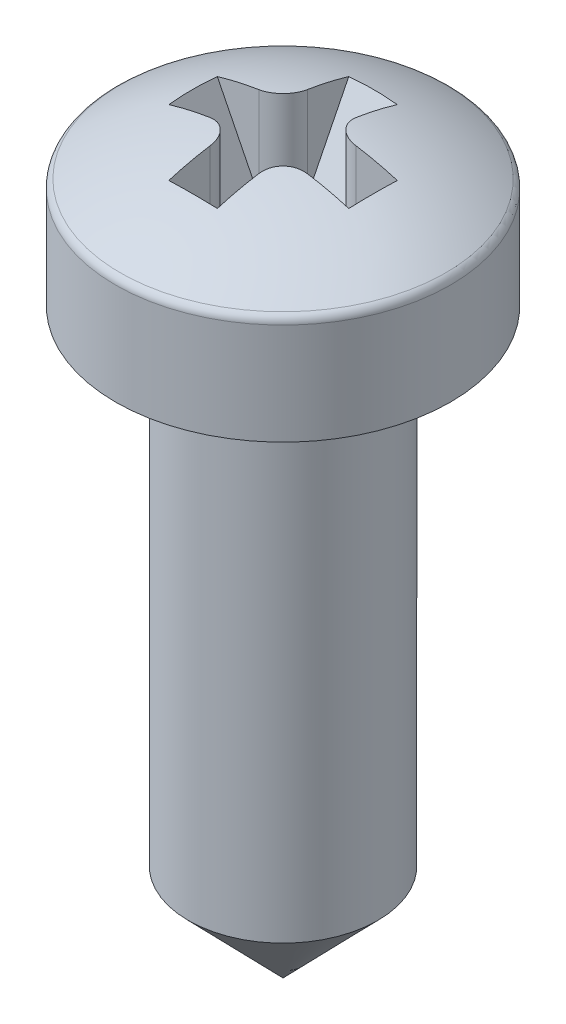
ISO-10303-21;
HEADER;
FILE_DESCRIPTION(('STEP AP214'),'2;1');
FILE_NAME('part.step','',(''),(''),'','','');
FILE_SCHEMA(('AUTOMOTIVE_DESIGN { 1 0 10303 214 1 1 1 1 }'));
ENDSEC;
DATA;
#1=APPLICATION_CONTEXT('core data for automotive mechanical design processes');
#2=APPLICATION_PROTOCOL_DEFINITION('international standard','automotive_design',2000,#1);
#3=PRODUCT_CONTEXT('',#1,'mechanical');
#4=PRODUCT('Part','Part','',(#3));
#5=PRODUCT_RELATED_PRODUCT_CATEGORY('part','',(#4));
#6=PRODUCT_DEFINITION_FORMATION('','',#4);
#7=PRODUCT_DEFINITION_CONTEXT('part definition',#1,'design');
#8=PRODUCT_DEFINITION('design','',#6,#7);
#9=PRODUCT_DEFINITION_SHAPE('','',#8);
#10=(LENGTH_UNIT() NAMED_UNIT(*) SI_UNIT(.MILLI.,.METRE.));
#11=(NAMED_UNIT(*) PLANE_ANGLE_UNIT() SI_UNIT($,.RADIAN.));
#12=(NAMED_UNIT(*) SI_UNIT($,.STERADIAN.) SOLID_ANGLE_UNIT());
#13=UNCERTAINTY_MEASURE_WITH_UNIT(LENGTH_MEASURE(1.E-05),#10,'distance_accuracy_value','');
#14=(GEOMETRIC_REPRESENTATION_CONTEXT(3) GLOBAL_UNCERTAINTY_ASSIGNED_CONTEXT((#13)) GLOBAL_UNIT_ASSIGNED_CONTEXT((#10,
#11,#12)) REPRESENTATION_CONTEXT('',''));
#15=CARTESIAN_POINT('',(0.,0.,0.));
#16=DIRECTION('',(0.,0.,1.));
#17=DIRECTION('',(1.,0.,0.));
#18=AXIS2_PLACEMENT_3D('',#15,#16,#17);
#19=CARTESIAN_POINT('',(0.,0.,0.));
#20=DIRECTION('',(0.,1.,0.));
#21=DIRECTION('',(0.,0.,1.));
#22=AXIS2_PLACEMENT_3D('',#19,#20,#21);
#23=PLANE('',#22);
#24=CARTESIAN_POINT('',(0.,0.,0.));
#25=DIRECTION('',(0.,1.,0.));
#26=DIRECTION('',(0.,0.,1.));
#27=AXIS2_PLACEMENT_3D('',#24,#25,#26);
#28=CIRCLE('',#27,3.45);
#29=CARTESIAN_POINT('',(0.,0.,3.45));
#30=VERTEX_POINT('',#29);
#31=EDGE_CURVE('E339',#30,#30,#28,.T.);
#32=ORIENTED_EDGE('',*,*,#31,.F.);
#33=EDGE_LOOP('',(#32));
#34=FACE_BOUND('',#33,.T.);
#35=CARTESIAN_POINT('',(0.,0.,0.));
#36=DIRECTION('',(0.,1.,0.));
#37=DIRECTION('',(0.,0.,1.));
#38=AXIS2_PLACEMENT_3D('',#35,#36,#37);
#39=CIRCLE('',#38,1.95);
#40=CARTESIAN_POINT('',(0.,0.,1.95));
#41=VERTEX_POINT('',#40);
#42=EDGE_CURVE('E336',#41,#41,#39,.F.);
#43=ORIENTED_EDGE('',*,*,#42,.F.);
#44=EDGE_LOOP('',(#43));
#45=FACE_BOUND('',#44,.T.);
#46=ADVANCED_FACE('F32',(#34,#45),#23,.F.);
#47=CARTESIAN_POINT('',(0.,2.2,0.));
#48=DIRECTION('',(0.,-1.,0.));
#49=DIRECTION('',(0.,0.,-1.));
#50=AXIS2_PLACEMENT_3D('',#47,#48,#49);
#51=CYLINDRICAL_SURFACE('',#50,3.45);
#52=CARTESIAN_POINT('',(0.,2.08875248712489,0.));
#53=DIRECTION('',(0.,-1.,0.));
#54=DIRECTION('',(0.,0.,-1.));
#55=AXIS2_PLACEMENT_3D('',#52,#53,#54);
#56=CIRCLE('',#55,3.45);
#57=CARTESIAN_POINT('',(0.,2.08875248712489,-3.45));
#58=VERTEX_POINT('',#57);
#59=EDGE_CURVE('E327',#58,#58,#56,.T.);
#60=ORIENTED_EDGE('',*,*,#59,.T.);
#61=EDGE_LOOP('',(#60));
#62=FACE_BOUND('',#61,.T.);
#63=ORIENTED_EDGE('',*,*,#31,.T.);
#64=EDGE_LOOP('',(#63));
#65=FACE_BOUND('',#64,.T.);
#66=ADVANCED_FACE('F146',(#62,#65),#51,.T.);
#67=CARTESIAN_POINT('',(0.,-3.25125,0.));
#68=DIRECTION('',(0.,0.,1.));
#69=DIRECTION('',(1.,0.,0.));
#70=AXIS2_PLACEMENT_3D('',#67,#68,#69);
#71=SPHERICAL_SURFACE('',#70,6.45125);
#72=CARTESIAN_POINT('',(-0.5,-3.25125,0.));
#73=DIRECTION('',(-1.,0.,0.));
#74=DIRECTION('',(0.,0.,1.));
#75=AXIS2_PLACEMENT_3D('',#72,#73,#74);
#76=CIRCLE('',#75,6.43184472468825);
#77=CARTESIAN_POINT('',(-0.5,3.10238097468684,1.));
#78=VERTEX_POINT('',#77);
#79=CARTESIAN_POINT('',(-0.5,2.90764366493432,1.85382183246716));
#80=VERTEX_POINT('',#79);
#81=EDGE_CURVE('E306',#78,#80,#76,.F.);
#82=ORIENTED_EDGE('',*,*,#81,.F.);
#83=CARTESIAN_POINT('',(-0.5,3.10238097468684,1.));
#84=CARTESIAN_POINT('',(-0.499975195760788,3.10673438845621,0.972364508087572));
#85=CARTESIAN_POINT('',(-0.502290117258133,3.11072459761779,0.944669073248839));
#86=CARTESIAN_POINT('',(-0.511481797928051,3.11787835492255,0.889939977008393));
#87=CARTESIAN_POINT('',(-0.51835803182,3.12104199819457,0.862906239777261));
#88=CARTESIAN_POINT('',(-0.536563939533955,3.12644614170445,0.810248959480661));
#89=CARTESIAN_POINT('',(-0.547898093791047,3.12868570854423,0.784626864815989));
#90=CARTESIAN_POINT('',(-0.574713648113397,3.13216743478294,0.735592096428243));
#91=CARTESIAN_POINT('',(-0.590193251223239,3.13341002541741,0.712178471317527));
#92=CARTESIAN_POINT('',(-0.624641996725747,3.13485007024244,0.668534488015013));
#93=CARTESIAN_POINT('',(-0.643563281484364,3.13506086934354,0.648266785274757));
#94=CARTESIAN_POINT('',(-0.684486330764666,3.13446686521321,0.611137051910229));
#95=CARTESIAN_POINT('',(-0.706488459759454,3.13366194172837,0.594275424812246));
#96=CARTESIAN_POINT('',(-0.752789291528574,3.13106955452091,0.564523366769589));
#97=CARTESIAN_POINT('',(-0.777073551147957,3.129287965258,0.551609904725466));
#98=CARTESIAN_POINT('',(-0.827355150609405,3.12479984438961,0.529954823615046));
#99=CARTESIAN_POINT('',(-0.853352118617411,3.12209351301772,0.52121230239979));
#100=CARTESIAN_POINT('',(-0.899533861080243,3.11663909185702,0.509776371995801));
#101=CARTESIAN_POINT('',(-0.919506050104829,3.11407843900143,0.506108020278519));
#102=CARTESIAN_POINT('',(-0.959660663494023,3.10853573262139,0.501219166253551));
#103=CARTESIAN_POINT('',(-0.979842743940679,3.1055542908469,0.499995148791129));
#104=CARTESIAN_POINT('',(-1.,3.10238097468684,0.5));
#105=B_SPLINE_CURVE_WITH_KNOTS('',3,(#83,#84,#85,#86,#87,#88,#89,#90,#91,#92,#93,#94,#95,#96,
#97,#98,#99,#100,#101,#102,#103,#104),.UNSPECIFIED.,.F.,.F.,(4,2,2,2,2,2,2,2,2,2,4),(0.,
0.0838351087463272,0.167660564719248,0.251570485679243,0.335444092355853,0.418229980858303,
0.501025671466905,0.583328740318609,0.66561399944084,0.726869734567323,0.788037315262509),.UNSPECIFIED.);
#106=CARTESIAN_POINT('',(-1.,3.10238097468684,0.5));
#107=VERTEX_POINT('',#106);
#108=EDGE_CURVE('E183',#78,#107,#105,.T.);
#109=ORIENTED_EDGE('',*,*,#108,.T.);
#110=CARTESIAN_POINT('',(0.,-3.25125,0.5));
#111=DIRECTION('',(0.,0.,1.));
#112=DIRECTION('',(1.,0.,0.));
#113=AXIS2_PLACEMENT_3D('',#110,#111,#112);
#114=CIRCLE('',#113,6.43184472468825);
#115=CARTESIAN_POINT('',(-1.85382183246716,2.90764366493432,0.5));
#116=VERTEX_POINT('',#115);
#117=EDGE_CURVE('E323',#116,#107,#114,.F.);
#118=ORIENTED_EDGE('',*,*,#117,.F.);
#119=CARTESIAN_POINT('',(0.9805,-2.761,0.));
#120=DIRECTION('',(-0.894427190999916,-0.447213595499958,0.));
#121=DIRECTION('',(0.447213595499958,-0.894427190999916,0.));
#122=AXIS2_PLACEMENT_3D('',#119,#120,#121);
#123=CIRCLE('',#122,6.35742882382493);
#124=CARTESIAN_POINT('',(-1.85382183246716,2.90764366493432,-0.5));
#125=VERTEX_POINT('',#124);
#126=EDGE_CURVE('E237',#116,#125,#123,.T.);
#127=ORIENTED_EDGE('',*,*,#126,.T.);
#128=CARTESIAN_POINT('',(0.,-3.25125,-0.5));
#129=DIRECTION('',(0.,0.,-1.));
#130=DIRECTION('',(-1.,0.,0.));
#131=AXIS2_PLACEMENT_3D('',#128,#129,#130);
#132=CIRCLE('',#131,6.43184472468825);
#133=CARTESIAN_POINT('',(-1.,3.10238097468684,-0.5));
#134=VERTEX_POINT('',#133);
#135=EDGE_CURVE('E250',#134,#125,#132,.F.);
#136=ORIENTED_EDGE('',*,*,#135,.F.);
#137=CARTESIAN_POINT('',(-1.,3.10238097468684,-0.5));
#138=CARTESIAN_POINT('',(-0.972364508087572,3.10673438845621,-0.499975195760788));
#139=CARTESIAN_POINT('',(-0.944669073248839,3.11072459761779,-0.502290117258133));
#140=CARTESIAN_POINT('',(-0.889939977008393,3.11787835492255,-0.511481797928051));
#141=CARTESIAN_POINT('',(-0.862906239777261,3.12104199819457,-0.51835803182));
#142=CARTESIAN_POINT('',(-0.810248959480661,3.12644614170445,-0.536563939533956));
#143=CARTESIAN_POINT('',(-0.78462686481599,3.12868570854423,-0.547898093791047));
#144=CARTESIAN_POINT('',(-0.735592096428243,3.13216743478294,-0.574713648113397));
#145=CARTESIAN_POINT('',(-0.712178471317528,3.13341002541741,-0.590193251223239));
#146=CARTESIAN_POINT('',(-0.668534488015013,3.13485007024244,-0.624641996725747));
#147=CARTESIAN_POINT('',(-0.648266785274757,3.13506086934354,-0.643563281484364));
#148=CARTESIAN_POINT('',(-0.61113705191023,3.13446686521321,-0.684486330764666));
#149=CARTESIAN_POINT('',(-0.594275424812246,3.13366194172837,-0.706488459759454));
#150=CARTESIAN_POINT('',(-0.564523366769589,3.13106955452091,-0.752789291528575));
#151=CARTESIAN_POINT('',(-0.551609904725466,3.129287965258,-0.777073551147958));
#152=CARTESIAN_POINT('',(-0.529954823615047,3.12479984438961,-0.827355150609405));
#153=CARTESIAN_POINT('',(-0.52121230239979,3.12209351301772,-0.853352118617412));
#154=CARTESIAN_POINT('',(-0.509776371995801,3.11663909185702,-0.899533861080243));
#155=CARTESIAN_POINT('',(-0.506108020278519,3.11407843900143,-0.91950605010483));
#156=CARTESIAN_POINT('',(-0.501219166253552,3.10853573262139,-0.959660663494023));
#157=CARTESIAN_POINT('',(-0.499995148791129,3.1055542908469,-0.979842743940679));
#158=CARTESIAN_POINT('',(-0.5,3.10238097468684,-1.));
#159=B_SPLINE_CURVE_WITH_KNOTS('',3,(#137,#138,#139,#140,#141,#142,#143,#144,#145,#146,#147,
#148,#149,#150,#151,#152,#153,#154,#155,#156,#157,#158),.UNSPECIFIED.,.F.,.F.,(4,2,2,2,2,2,2,2,
2,2,4),(0.,0.0838351087463272,0.167660564719248,0.251570485679243,0.335444092355853,
0.418229980858303,0.501025671466905,0.583328740318609,0.66561399944084,0.726869734567323,
0.788037315262509),.UNSPECIFIED.);
#160=CARTESIAN_POINT('',(-0.5,3.10238097468684,-1.));
#161=VERTEX_POINT('',#160);
#162=EDGE_CURVE('E171',#134,#161,#159,.T.);
#163=ORIENTED_EDGE('',*,*,#162,.T.);
#164=CARTESIAN_POINT('',(-0.5,-3.25125,0.));
#165=DIRECTION('',(-1.,0.,0.));
#166=DIRECTION('',(0.,0.,1.));
#167=AXIS2_PLACEMENT_3D('',#164,#165,#166);
#168=CIRCLE('',#167,6.43184472468825);
#169=CARTESIAN_POINT('',(-0.5,2.90764366493432,-1.85382183246716));
#170=VERTEX_POINT('',#169);
#171=EDGE_CURVE('E244',#170,#161,#168,.F.);
#172=ORIENTED_EDGE('',*,*,#171,.F.);
#173=CARTESIAN_POINT('',(0.,-2.761,0.9805));
#174=DIRECTION('',(0.,-0.447213595499958,-0.894427190999916));
#175=DIRECTION('',(0.,0.894427190999916,-0.447213595499958));
#176=AXIS2_PLACEMENT_3D('',#173,#174,#175);
#177=CIRCLE('',#176,6.35742882382493);
#178=CARTESIAN_POINT('',(0.5,2.90764366493432,-1.85382183246716));
#179=VERTEX_POINT('',#178);
#180=EDGE_CURVE('E41',#170,#179,#177,.T.);
#181=ORIENTED_EDGE('',*,*,#180,.T.);
#182=CARTESIAN_POINT('',(0.5,-3.25125,0.));
#183=DIRECTION('',(1.,0.,0.));
#184=DIRECTION('',(0.,0.,-1.));
#185=AXIS2_PLACEMENT_3D('',#182,#183,#184);
#186=CIRCLE('',#185,6.43184472468825);
#187=CARTESIAN_POINT('',(0.5,3.10238097468684,-1.));
#188=VERTEX_POINT('',#187);
#189=EDGE_CURVE('E242',#188,#179,#186,.F.);
#190=ORIENTED_EDGE('',*,*,#189,.F.);
#191=CARTESIAN_POINT('',(0.5,3.10238097468684,-1.));
#192=CARTESIAN_POINT('',(0.499975195760788,3.10673438845621,-0.972364508087572));
#193=CARTESIAN_POINT('',(0.502290117258133,3.11072459761779,-0.944669073248839));
#194=CARTESIAN_POINT('',(0.51148179792805,3.11787835492255,-0.889939977008393));
#195=CARTESIAN_POINT('',(0.51835803182,3.12104199819457,-0.862906239777261));
#196=CARTESIAN_POINT('',(0.536563939533955,3.12644614170445,-0.810248959480661));
#197=CARTESIAN_POINT('',(0.547898093791047,3.12868570854423,-0.784626864815989));
#198=CARTESIAN_POINT('',(0.574713648113397,3.13216743478294,-0.735592096428243));
#199=CARTESIAN_POINT('',(0.590193251223239,3.13341002541741,-0.712178471317527));
#200=CARTESIAN_POINT('',(0.624641996725747,3.13485007024244,-0.668534488015013));
#201=CARTESIAN_POINT('',(0.643563281484364,3.13506086934354,-0.648266785274757));
#202=CARTESIAN_POINT('',(0.684486330764666,3.13446686521321,-0.611137051910229));
#203=CARTESIAN_POINT('',(0.706488459759454,3.13366194172837,-0.594275424812246));
#204=CARTESIAN_POINT('',(0.752789291528575,3.13106955452091,-0.564523366769589));
#205=CARTESIAN_POINT('',(0.777073551147958,3.129287965258,-0.551609904725466));
#206=CARTESIAN_POINT('',(0.827355150609405,3.12479984438961,-0.529954823615046));
#207=CARTESIAN_POINT('',(0.853352118617412,3.12209351301772,-0.52121230239979));
#208=CARTESIAN_POINT('',(0.899533861080243,3.11663909185702,-0.509776371995801));
#209=CARTESIAN_POINT('',(0.919506050104829,3.11407843900143,-0.506108020278519));
#210=CARTESIAN_POINT('',(0.959660663494023,3.10853573262139,-0.501219166253552));
#211=CARTESIAN_POINT('',(0.979842743940679,3.1055542908469,-0.499995148791129));
#212=CARTESIAN_POINT('',(1.,3.10238097468684,-0.5));
#213=B_SPLINE_CURVE_WITH_KNOTS('',3,(#191,#192,#193,#194,#195,#196,#197,#198,#199,#200,#201,
#202,#203,#204,#205,#206,#207,#208,#209,#210,#211,#212),.UNSPECIFIED.,.F.,.F.,(4,2,2,2,2,2,2,2,
2,2,4),(0.,0.0838351087463272,0.167660564719248,0.251570485679243,0.335444092355853,
0.418229980858303,0.501025671466906,0.583328740318609,0.66561399944084,0.726869734567323,
0.788037315262509),.UNSPECIFIED.);
#214=CARTESIAN_POINT('',(1.,3.10238097468684,-0.5));
#215=VERTEX_POINT('',#214);
#216=EDGE_CURVE('E162',#188,#215,#213,.T.);
#217=ORIENTED_EDGE('',*,*,#216,.T.);
#218=CARTESIAN_POINT('',(0.,-3.25125,-0.5));
#219=DIRECTION('',(0.,0.,-1.));
#220=DIRECTION('',(-1.,0.,0.));
#221=AXIS2_PLACEMENT_3D('',#218,#219,#220);
#222=CIRCLE('',#221,6.43184472468825);
#223=CARTESIAN_POINT('',(1.85382183246716,2.90764366493432,-0.5));
#224=VERTEX_POINT('',#223);
#225=EDGE_CURVE('E248',#224,#215,#222,.F.);
#226=ORIENTED_EDGE('',*,*,#225,.F.);
#227=CARTESIAN_POINT('',(-0.9805,-2.761,0.));
#228=DIRECTION('',(0.894427190999916,-0.447213595499958,0.));
#229=DIRECTION('',(0.447213595499958,0.894427190999916,0.));
#230=AXIS2_PLACEMENT_3D('',#227,#228,#229);
#231=CIRCLE('',#230,6.35742882382493);
#232=CARTESIAN_POINT('',(1.85382183246716,2.90764366493432,0.5));
#233=VERTEX_POINT('',#232);
#234=EDGE_CURVE('E11',#224,#233,#231,.T.);
#235=ORIENTED_EDGE('',*,*,#234,.T.);
#236=CARTESIAN_POINT('',(0.,-3.25125,0.5));
#237=DIRECTION('',(0.,0.,1.));
#238=DIRECTION('',(1.,0.,0.));
#239=AXIS2_PLACEMENT_3D('',#236,#237,#238);
#240=CIRCLE('',#239,6.43184472468825);
#241=CARTESIAN_POINT('',(1.,3.10238097468684,0.5));
#242=VERTEX_POINT('',#241);
#243=EDGE_CURVE('E252',#242,#233,#240,.F.);
#244=ORIENTED_EDGE('',*,*,#243,.F.);
#245=CARTESIAN_POINT('',(1.,3.10238097468684,0.5));
#246=CARTESIAN_POINT('',(0.972364508087572,3.10673438845621,0.499975195760788));
#247=CARTESIAN_POINT('',(0.944669073248839,3.11072459761779,0.502290117258133));
#248=CARTESIAN_POINT('',(0.889939977008393,3.11787835492255,0.511481797928051));
#249=CARTESIAN_POINT('',(0.862906239777261,3.12104199819457,0.51835803182));
#250=CARTESIAN_POINT('',(0.810248959480661,3.12644614170445,0.536563939533955));
#251=CARTESIAN_POINT('',(0.784626864815989,3.12868570854423,0.547898093791047));
#252=CARTESIAN_POINT('',(0.735592096428243,3.13216743478294,0.574713648113397));
#253=CARTESIAN_POINT('',(0.712178471317527,3.13341002541741,0.590193251223239));
#254=CARTESIAN_POINT('',(0.668534488015013,3.13485007024244,0.624641996725747));
#255=CARTESIAN_POINT('',(0.648266785274757,3.13506086934354,0.643563281484364));
#256=CARTESIAN_POINT('',(0.611137051910229,3.13446686521321,0.684486330764666));
#257=CARTESIAN_POINT('',(0.594275424812246,3.13366194172837,0.706488459759454));
#258=CARTESIAN_POINT('',(0.564523366769589,3.13106955452091,0.752789291528574));
#259=CARTESIAN_POINT('',(0.551609904725466,3.129287965258,0.777073551147957));
#260=CARTESIAN_POINT('',(0.529954823615046,3.12479984438961,0.827355150609405));
#261=CARTESIAN_POINT('',(0.52121230239979,3.12209351301772,0.853352118617411));
#262=CARTESIAN_POINT('',(0.509776371995801,3.11663909185702,0.899533861080243));
#263=CARTESIAN_POINT('',(0.506108020278519,3.11407843900143,0.919506050104829));
#264=CARTESIAN_POINT('',(0.501219166253551,3.10853573262139,0.959660663494023));
#265=CARTESIAN_POINT('',(0.499995148791129,3.1055542908469,0.979842743940679));
#266=CARTESIAN_POINT('',(0.5,3.10238097468684,1.));
#267=B_SPLINE_CURVE_WITH_KNOTS('',3,(#245,#246,#247,#248,#249,#250,#251,#252,#253,#254,#255,
#256,#257,#258,#259,#260,#261,#262,#263,#264,#265,#266),.UNSPECIFIED.,.F.,.F.,(4,2,2,2,2,2,2,2,
2,2,4),(0.,0.0838351087463272,0.167660564719248,0.251570485679243,0.335444092355853,
0.418229980858303,0.501025671466905,0.583328740318609,0.66561399944084,0.726869734567323,
0.788037315262509),.UNSPECIFIED.);
#268=CARTESIAN_POINT('',(0.5,3.10238097468684,1.));
#269=VERTEX_POINT('',#268);
#270=EDGE_CURVE('E177',#242,#269,#267,.T.);
#271=ORIENTED_EDGE('',*,*,#270,.T.);
#272=CARTESIAN_POINT('',(0.5,-3.25125,0.));
#273=DIRECTION('',(1.,0.,0.));
#274=DIRECTION('',(0.,0.,-1.));
#275=AXIS2_PLACEMENT_3D('',#272,#273,#274);
#276=CIRCLE('',#275,6.43184472468825);
#277=CARTESIAN_POINT('',(0.5,2.90764366493432,1.85382183246716));
#278=VERTEX_POINT('',#277);
#279=EDGE_CURVE('E319',#278,#269,#276,.F.);
#280=ORIENTED_EDGE('',*,*,#279,.F.);
#281=CARTESIAN_POINT('',(0.,-2.761,-0.9805));
#282=DIRECTION('',(0.,-0.447213595499958,0.894427190999916));
#283=DIRECTION('',(0.,-0.894427190999916,-0.447213595499958));
#284=AXIS2_PLACEMENT_3D('',#281,#282,#283);
#285=CIRCLE('',#284,6.35742882382493);
#286=EDGE_CURVE('E74',#278,#80,#285,.T.);
#287=ORIENTED_EDGE('',*,*,#286,.T.);
#288=EDGE_LOOP('',(#82,#109,#118,#127,#136,#163,#172,#181,#190,#217,#226,#235,#244,#271,#280,#287));
#289=FACE_BOUND('',#288,.T.);
#290=CARTESIAN_POINT('',(0.,2.2595983975308,0.));
#291=DIRECTION('',(0.,-1.,0.));
#292=DIRECTION('',(0.,0.,-1.));
#293=AXIS2_PLACEMENT_3D('',#290,#291,#292);
#294=CIRCLE('',#293,3.35397920415917);
#295=CARTESIAN_POINT('',(0.,2.2595983975308,-3.35397920415917));
#296=VERTEX_POINT('',#295);
#297=EDGE_CURVE('E330',#296,#296,#294,.F.);
#298=ORIENTED_EDGE('',*,*,#297,.T.);
#299=EDGE_LOOP('',(#298));
#300=FACE_BOUND('',#299,.T.);
#301=ADVANCED_FACE('F140',(#289,#300),#71,.T.);
#302=CARTESIAN_POINT('',(0.,-12.,0.));
#303=DIRECTION('',(0.,1.,0.));
#304=DIRECTION('',(0.,0.,1.));
#305=AXIS2_PLACEMENT_3D('',#302,#303,#304);
#306=CYLINDRICAL_SURFACE('',#305,1.95);
#307=CARTESIAN_POINT('',(0.,-10.,0.));
#308=DIRECTION('',(0.,-1.,0.));
#309=DIRECTION('',(0.,0.,-1.));
#310=AXIS2_PLACEMENT_3D('',#307,#308,#309);
#311=CIRCLE('',#310,1.95);
#312=CARTESIAN_POINT('',(0.,-10.,-1.95));
#313=VERTEX_POINT('',#312);
#314=EDGE_CURVE('E333',#313,#313,#311,.F.);
#315=ORIENTED_EDGE('',*,*,#314,.T.);
#316=EDGE_LOOP('',(#315));
#317=FACE_BOUND('',#316,.T.);
#318=ORIENTED_EDGE('',*,*,#42,.T.);
#319=EDGE_LOOP('',(#318));
#320=FACE_BOUND('',#319,.T.);
#321=ADVANCED_FACE('F130',(#317,#320),#306,.T.);
#322=CARTESIAN_POINT('',(0.,-10.,0.));
#323=DIRECTION('',(0.,1.,0.));
#324=DIRECTION('',(0.,0.,1.));
#325=AXIS2_PLACEMENT_3D('',#322,#323,#324);
#326=CONICAL_SURFACE('',#325,1.95,0.772740611563396);
#327=ORIENTED_EDGE('',*,*,#314,.F.);
#328=EDGE_LOOP('',(#327));
#329=FACE_BOUND('',#328,.T.);
#330=CARTESIAN_POINT('',(0.,-12.,0.));
#331=VERTEX_POINT('',#330);
#332=VERTEX_LOOP('',#331);
#333=FACE_BOUND('',#332,.T.);
#334=ADVANCED_FACE('F127',(#329,#333),#326,.T.);
#335=CARTESIAN_POINT('',(0.,2.08875248712489,0.));
#336=DIRECTION('',(0.,-1.,0.));
#337=DIRECTION('',(0.,0.,-1.));
#338=AXIS2_PLACEMENT_3D('',#335,#336,#337);
#339=TOROIDAL_SURFACE('',#338,3.25,0.2);
#340=ORIENTED_EDGE('',*,*,#59,.F.);
#341=EDGE_LOOP('',(#340));
#342=FACE_BOUND('',#341,.T.);
#343=ORIENTED_EDGE('',*,*,#297,.F.);
#344=EDGE_LOOP('',(#343));
#345=FACE_BOUND('',#344,.T.);
#346=ADVANCED_FACE('F129',(#342,#345),#339,.T.);
#347=CARTESIAN_POINT('',(-0.5,1.2,-0.5));
#348=DIRECTION('',(0.,0.,-1.));
#349=DIRECTION('',(-1.,0.,0.));
#350=AXIS2_PLACEMENT_3D('',#347,#348,#349);
#351=PLANE('',#350);
#352=ORIENTED_EDGE('',*,*,#135,.T.);
#353=DIRECTION('',(0.447213595499958,-0.894427190999916,0.));
#354=VECTOR('',#353,1.);
#355=CARTESIAN_POINT('',(-1.,1.2,-0.5));
#356=LINE('',#355,#354);
#357=CARTESIAN_POINT('',(-1.,1.2,-0.5));
#358=VERTEX_POINT('',#357);
#359=EDGE_CURVE('E301',#125,#358,#356,.T.);
#360=ORIENTED_EDGE('',*,*,#359,.T.);
#361=DIRECTION('',(0.,1.,0.));
#362=VECTOR('',#361,1.);
#363=CARTESIAN_POINT('',(-1.,1.2,-0.5));
#364=LINE('',#363,#362);
#365=EDGE_CURVE('E270',#358,#134,#364,.T.);
#366=ORIENTED_EDGE('',*,*,#365,.T.);
#367=EDGE_LOOP('',(#352,#360,#366));
#368=FACE_BOUND('',#367,.T.);
#369=ADVANCED_FACE('F137',(#368),#351,.F.);
#370=CARTESIAN_POINT('',(-0.5,1.2,-2.));
#371=DIRECTION('',(-1.,0.,0.));
#372=DIRECTION('',(0.,0.,1.));
#373=AXIS2_PLACEMENT_3D('',#370,#371,#372);
#374=PLANE('',#373);
#375=DIRECTION('',(0.,1.,0.));
#376=VECTOR('',#375,1.);
#377=CARTESIAN_POINT('',(-0.5,1.2,-1.));
#378=LINE('',#377,#376);
#379=CARTESIAN_POINT('',(-0.5,1.2,-1.));
#380=VERTEX_POINT('',#379);
#381=EDGE_CURVE('E267',#161,#380,#378,.F.);
#382=ORIENTED_EDGE('',*,*,#381,.T.);
#383=DIRECTION('',(0.,0.894427190999916,-0.447213595499958));
#384=VECTOR('',#383,1.);
#385=CARTESIAN_POINT('',(-0.5,1.2,-1.));
#386=LINE('',#385,#384);
#387=EDGE_CURVE('E67',#380,#170,#386,.T.);
#388=ORIENTED_EDGE('',*,*,#387,.T.);
#389=ORIENTED_EDGE('',*,*,#171,.T.);
#390=EDGE_LOOP('',(#382,#388,#389));
#391=FACE_BOUND('',#390,.T.);
#392=ADVANCED_FACE('F370',(#391),#374,.F.);
#393=CARTESIAN_POINT('',(0.5,1.2,-0.5));
#394=DIRECTION('',(1.,0.,0.));
#395=DIRECTION('',(0.,0.,-1.));
#396=AXIS2_PLACEMENT_3D('',#393,#394,#395);
#397=PLANE('',#396);
#398=ORIENTED_EDGE('',*,*,#189,.T.);
#399=DIRECTION('',(0.,-0.894427190999916,0.447213595499958));
#400=VECTOR('',#399,1.);
#401=CARTESIAN_POINT('',(0.5,1.2,-1.));
#402=LINE('',#401,#400);
#403=CARTESIAN_POINT('',(0.5,1.2,-1.));
#404=VERTEX_POINT('',#403);
#405=EDGE_CURVE('E221',#179,#404,#402,.T.);
#406=ORIENTED_EDGE('',*,*,#405,.T.);
#407=DIRECTION('',(0.,1.,0.));
#408=VECTOR('',#407,1.);
#409=CARTESIAN_POINT('',(0.5,1.2,-1.));
#410=LINE('',#409,#408);
#411=EDGE_CURVE('E247',#404,#188,#410,.T.);
#412=ORIENTED_EDGE('',*,*,#411,.T.);
#413=EDGE_LOOP('',(#398,#406,#412));
#414=FACE_BOUND('',#413,.T.);
#415=ADVANCED_FACE('F245',(#414),#397,.F.);
#416=CARTESIAN_POINT('',(2.,1.2,-0.5));
#417=DIRECTION('',(0.,0.,-1.));
#418=DIRECTION('',(-1.,0.,0.));
#419=AXIS2_PLACEMENT_3D('',#416,#417,#418);
#420=PLANE('',#419);
#421=DIRECTION('',(0.,1.,0.));
#422=VECTOR('',#421,1.);
#423=CARTESIAN_POINT('',(1.,1.2,-0.5));
#424=LINE('',#423,#422);
#425=CARTESIAN_POINT('',(1.,1.2,-0.5));
#426=VERTEX_POINT('',#425);
#427=EDGE_CURVE('E272',#215,#426,#424,.F.);
#428=ORIENTED_EDGE('',*,*,#427,.T.);
#429=DIRECTION('',(0.447213595499958,0.894427190999916,0.));
#430=VECTOR('',#429,1.);
#431=CARTESIAN_POINT('',(1.,1.2,-0.5));
#432=LINE('',#431,#430);
#433=EDGE_CURVE('E228',#426,#224,#432,.T.);
#434=ORIENTED_EDGE('',*,*,#433,.T.);
#435=ORIENTED_EDGE('',*,*,#225,.T.);
#436=EDGE_LOOP('',(#428,#434,#435));
#437=FACE_BOUND('',#436,.T.);
#438=ADVANCED_FACE('F362',(#437),#420,.F.);
#439=CARTESIAN_POINT('',(0.5,1.2,0.5));
#440=DIRECTION('',(0.,0.,1.));
#441=DIRECTION('',(1.,0.,0.));
#442=AXIS2_PLACEMENT_3D('',#439,#440,#441);
#443=PLANE('',#442);
#444=ORIENTED_EDGE('',*,*,#243,.T.);
#445=DIRECTION('',(-0.447213595499958,-0.894427190999916,0.));
#446=VECTOR('',#445,1.);
#447=CARTESIAN_POINT('',(1.,1.2,0.5));
#448=LINE('',#447,#446);
#449=CARTESIAN_POINT('',(1.,1.2,0.5));
#450=VERTEX_POINT('',#449);
#451=EDGE_CURVE('E230',#233,#450,#448,.T.);
#452=ORIENTED_EDGE('',*,*,#451,.T.);
#453=DIRECTION('',(0.,1.,0.));
#454=VECTOR('',#453,1.);
#455=CARTESIAN_POINT('',(1.,1.2,0.5));
#456=LINE('',#455,#454);
#457=EDGE_CURVE('E352',#450,#242,#456,.T.);
#458=ORIENTED_EDGE('',*,*,#457,.T.);
#459=EDGE_LOOP('',(#444,#452,#458));
#460=FACE_BOUND('',#459,.T.);
#461=ADVANCED_FACE('F357',(#460),#443,.F.);
#462=CARTESIAN_POINT('',(0.5,1.2,2.));
#463=DIRECTION('',(1.,0.,0.));
#464=DIRECTION('',(0.,0.,-1.));
#465=AXIS2_PLACEMENT_3D('',#462,#463,#464);
#466=PLANE('',#465);
#467=DIRECTION('',(0.,1.,0.));
#468=VECTOR('',#467,1.);
#469=CARTESIAN_POINT('',(0.5,1.2,1.));
#470=LINE('',#469,#468);
#471=CARTESIAN_POINT('',(0.5,1.2,1.));
#472=VERTEX_POINT('',#471);
#473=EDGE_CURVE('E274',#269,#472,#470,.F.);
#474=ORIENTED_EDGE('',*,*,#473,.T.);
#475=DIRECTION('',(0.,0.894427190999916,0.447213595499958));
#476=VECTOR('',#475,1.);
#477=CARTESIAN_POINT('',(0.5,1.2,1.));
#478=LINE('',#477,#476);
#479=EDGE_CURVE('E303',#472,#278,#478,.T.);
#480=ORIENTED_EDGE('',*,*,#479,.T.);
#481=ORIENTED_EDGE('',*,*,#279,.T.);
#482=EDGE_LOOP('',(#474,#480,#481));
#483=FACE_BOUND('',#482,.T.);
#484=ADVANCED_FACE('F318',(#483),#466,.F.);
#485=CARTESIAN_POINT('',(-0.5,1.2,0.5));
#486=DIRECTION('',(-1.,0.,0.));
#487=DIRECTION('',(0.,0.,1.));
#488=AXIS2_PLACEMENT_3D('',#485,#486,#487);
#489=PLANE('',#488);
#490=ORIENTED_EDGE('',*,*,#81,.T.);
#491=DIRECTION('',(0.,-0.894427190999916,-0.447213595499958));
#492=VECTOR('',#491,1.);
#493=CARTESIAN_POINT('',(-0.5,1.2,1.));
#494=LINE('',#493,#492);
#495=CARTESIAN_POINT('',(-0.5,1.2,1.));
#496=VERTEX_POINT('',#495);
#497=EDGE_CURVE('E232',#80,#496,#494,.T.);
#498=ORIENTED_EDGE('',*,*,#497,.T.);
#499=DIRECTION('',(0.,1.,0.));
#500=VECTOR('',#499,1.);
#501=CARTESIAN_POINT('',(-0.5,1.2,1.));
#502=LINE('',#501,#500);
#503=EDGE_CURVE('E257',#496,#78,#502,.T.);
#504=ORIENTED_EDGE('',*,*,#503,.T.);
#505=EDGE_LOOP('',(#490,#498,#504));
#506=FACE_BOUND('',#505,.T.);
#507=ADVANCED_FACE('F305',(#506),#489,.F.);
#508=CARTESIAN_POINT('',(-2.,1.2,0.5));
#509=DIRECTION('',(0.,0.,1.));
#510=DIRECTION('',(1.,0.,0.));
#511=AXIS2_PLACEMENT_3D('',#508,#509,#510);
#512=PLANE('',#511);
#513=DIRECTION('',(0.,1.,0.));
#514=VECTOR('',#513,1.);
#515=CARTESIAN_POINT('',(-1.,1.2,0.5));
#516=LINE('',#515,#514);
#517=CARTESIAN_POINT('',(-1.,1.2,0.5));
#518=VERTEX_POINT('',#517);
#519=EDGE_CURVE('E350',#107,#518,#516,.F.);
#520=ORIENTED_EDGE('',*,*,#519,.T.);
#521=DIRECTION('',(-0.447213595499958,0.894427190999916,0.));
#522=VECTOR('',#521,1.);
#523=CARTESIAN_POINT('',(-1.,1.2,0.5));
#524=LINE('',#523,#522);
#525=EDGE_CURVE('E299',#518,#116,#524,.T.);
#526=ORIENTED_EDGE('',*,*,#525,.T.);
#527=ORIENTED_EDGE('',*,*,#117,.T.);
#528=EDGE_LOOP('',(#520,#526,#527));
#529=FACE_BOUND('',#528,.T.);
#530=ADVANCED_FACE('F349',(#529),#512,.F.);
#531=CARTESIAN_POINT('',(0.,1.2,0.));
#532=DIRECTION('',(0.,1.,0.));
#533=DIRECTION('',(0.,0.,1.));
#534=AXIS2_PLACEMENT_3D('',#531,#532,#533);
#535=PLANE('',#534);
#536=CARTESIAN_POINT('',(-1.,1.2,-1.));
#537=DIRECTION('',(0.,1.,0.));
#538=DIRECTION('',(0.,0.,1.));
#539=AXIS2_PLACEMENT_3D('',#536,#537,#538);
#540=CIRCLE('',#539,0.5);
#541=EDGE_CURVE('E269',#380,#358,#540,.F.);
#542=ORIENTED_EDGE('',*,*,#541,.T.);
#543=DIRECTION('',(0.,0.,1.));
#544=VECTOR('',#543,1.);
#545=CARTESIAN_POINT('',(-1.,1.2,0.));
#546=LINE('',#545,#544);
#547=EDGE_CURVE('E296',#358,#518,#546,.T.);
#548=ORIENTED_EDGE('',*,*,#547,.T.);
#549=CARTESIAN_POINT('',(-1.,1.2,1.));
#550=DIRECTION('',(0.,1.,0.));
#551=DIRECTION('',(0.,0.,1.));
#552=AXIS2_PLACEMENT_3D('',#549,#550,#551);
#553=CIRCLE('',#552,0.5);
#554=EDGE_CURVE('E280',#518,#496,#553,.F.);
#555=ORIENTED_EDGE('',*,*,#554,.T.);
#556=DIRECTION('',(1.,0.,0.));
#557=VECTOR('',#556,1.);
#558=CARTESIAN_POINT('',(0.,1.2,1.));
#559=LINE('',#558,#557);
#560=EDGE_CURVE('E293',#496,#472,#559,.T.);
#561=ORIENTED_EDGE('',*,*,#560,.T.);
#562=CARTESIAN_POINT('',(1.,1.2,1.));
#563=DIRECTION('',(0.,1.,0.));
#564=DIRECTION('',(0.,0.,1.));
#565=AXIS2_PLACEMENT_3D('',#562,#563,#564);
#566=CIRCLE('',#565,0.5);
#567=EDGE_CURVE('E283',#472,#450,#566,.F.);
#568=ORIENTED_EDGE('',*,*,#567,.T.);
#569=DIRECTION('',(0.,0.,-1.));
#570=VECTOR('',#569,1.);
#571=CARTESIAN_POINT('',(1.,1.2,0.));
#572=LINE('',#571,#570);
#573=EDGE_CURVE('E289',#450,#426,#572,.T.);
#574=ORIENTED_EDGE('',*,*,#573,.T.);
#575=CARTESIAN_POINT('',(1.,1.2,-1.));
#576=DIRECTION('',(0.,1.,0.));
#577=DIRECTION('',(0.,0.,1.));
#578=AXIS2_PLACEMENT_3D('',#575,#576,#577);
#579=CIRCLE('',#578,0.5);
#580=EDGE_CURVE('E287',#426,#404,#579,.F.);
#581=ORIENTED_EDGE('',*,*,#580,.T.);
#582=DIRECTION('',(-1.,0.,0.));
#583=VECTOR('',#582,1.);
#584=CARTESIAN_POINT('',(0.,1.2,-1.));
#585=LINE('',#584,#583);
#586=EDGE_CURVE('E223',#404,#380,#585,.T.);
#587=ORIENTED_EDGE('',*,*,#586,.T.);
#588=EDGE_LOOP('',(#542,#548,#555,#561,#568,#574,#581,#587));
#589=FACE_BOUND('',#588,.T.);
#590=ADVANCED_FACE('F310',(#589),#535,.T.);
#591=CARTESIAN_POINT('',(-1.,1.2,1.));
#592=DIRECTION('',(0.,1.,0.));
#593=DIRECTION('',(0.,0.,1.));
#594=AXIS2_PLACEMENT_3D('',#591,#592,#593);
#595=CYLINDRICAL_SURFACE('',#594,0.5);
#596=ORIENTED_EDGE('',*,*,#554,.F.);
#597=ORIENTED_EDGE('',*,*,#519,.F.);
#598=ORIENTED_EDGE('',*,*,#108,.F.);
#599=ORIENTED_EDGE('',*,*,#503,.F.);
#600=EDGE_LOOP('',(#596,#597,#598,#599));
#601=FACE_BOUND('',#600,.T.);
#602=ADVANCED_FACE('F193',(#601),#595,.T.);
#603=CARTESIAN_POINT('',(1.,1.2,1.));
#604=DIRECTION('',(0.,1.,0.));
#605=DIRECTION('',(0.,0.,1.));
#606=AXIS2_PLACEMENT_3D('',#603,#604,#605);
#607=CYLINDRICAL_SURFACE('',#606,0.5);
#608=ORIENTED_EDGE('',*,*,#567,.F.);
#609=ORIENTED_EDGE('',*,*,#473,.F.);
#610=ORIENTED_EDGE('',*,*,#270,.F.);
#611=ORIENTED_EDGE('',*,*,#457,.F.);
#612=EDGE_LOOP('',(#608,#609,#610,#611));
#613=FACE_BOUND('',#612,.T.);
#614=ADVANCED_FACE('F189',(#613),#607,.T.);
#615=CARTESIAN_POINT('',(-1.,1.2,-1.));
#616=DIRECTION('',(0.,1.,0.));
#617=DIRECTION('',(0.,0.,1.));
#618=AXIS2_PLACEMENT_3D('',#615,#616,#617);
#619=CYLINDRICAL_SURFACE('',#618,0.5);
#620=ORIENTED_EDGE('',*,*,#541,.F.);
#621=ORIENTED_EDGE('',*,*,#381,.F.);
#622=ORIENTED_EDGE('',*,*,#162,.F.);
#623=ORIENTED_EDGE('',*,*,#365,.F.);
#624=EDGE_LOOP('',(#620,#621,#622,#623));
#625=FACE_BOUND('',#624,.T.);
#626=ADVANCED_FACE('F192',(#625),#619,.T.);
#627=CARTESIAN_POINT('',(1.,1.2,-1.));
#628=DIRECTION('',(0.,1.,0.));
#629=DIRECTION('',(0.,0.,1.));
#630=AXIS2_PLACEMENT_3D('',#627,#628,#629);
#631=CYLINDRICAL_SURFACE('',#630,0.5);
#632=ORIENTED_EDGE('',*,*,#580,.F.);
#633=ORIENTED_EDGE('',*,*,#427,.F.);
#634=ORIENTED_EDGE('',*,*,#216,.F.);
#635=ORIENTED_EDGE('',*,*,#411,.F.);
#636=EDGE_LOOP('',(#632,#633,#634,#635));
#637=FACE_BOUND('',#636,.T.);
#638=ADVANCED_FACE('F198',(#637),#631,.T.);
#639=CARTESIAN_POINT('',(-1.,1.2,0.));
#640=DIRECTION('',(-0.894427190999916,-0.447213595499958,0.));
#641=DIRECTION('',(0.,0.,1.));
#642=AXIS2_PLACEMENT_3D('',#639,#640,#641);
#643=PLANE('',#642);
#644=ORIENTED_EDGE('',*,*,#359,.F.);
#645=ORIENTED_EDGE('',*,*,#126,.F.);
#646=ORIENTED_EDGE('',*,*,#525,.F.);
#647=ORIENTED_EDGE('',*,*,#547,.F.);
#648=EDGE_LOOP('',(#644,#645,#646,#647));
#649=FACE_BOUND('',#648,.T.);
#650=ADVANCED_FACE('F203',(#649),#643,.F.);
#651=CARTESIAN_POINT('',(0.,1.2,1.));
#652=DIRECTION('',(0.,-0.447213595499958,0.894427190999916));
#653=DIRECTION('',(1.,0.,0.));
#654=AXIS2_PLACEMENT_3D('',#651,#652,#653);
#655=PLANE('',#654);
#656=ORIENTED_EDGE('',*,*,#497,.F.);
#657=ORIENTED_EDGE('',*,*,#286,.F.);
#658=ORIENTED_EDGE('',*,*,#479,.F.);
#659=ORIENTED_EDGE('',*,*,#560,.F.);
#660=EDGE_LOOP('',(#656,#657,#658,#659));
#661=FACE_BOUND('',#660,.T.);
#662=ADVANCED_FACE('F207',(#661),#655,.F.);
#663=CARTESIAN_POINT('',(0.,1.2,-1.));
#664=DIRECTION('',(0.,-0.447213595499958,-0.894427190999916));
#665=DIRECTION('',(-1.,0.,0.));
#666=AXIS2_PLACEMENT_3D('',#663,#664,#665);
#667=PLANE('',#666);
#668=ORIENTED_EDGE('',*,*,#405,.F.);
#669=ORIENTED_EDGE('',*,*,#180,.F.);
#670=ORIENTED_EDGE('',*,*,#387,.F.);
#671=ORIENTED_EDGE('',*,*,#586,.F.);
#672=EDGE_LOOP('',(#668,#669,#670,#671));
#673=FACE_BOUND('',#672,.T.);
#674=ADVANCED_FACE('F210',(#673),#667,.F.);
#675=CARTESIAN_POINT('',(1.,1.2,0.));
#676=DIRECTION('',(0.894427190999916,-0.447213595499958,0.));
#677=DIRECTION('',(0.,0.,-1.));
#678=AXIS2_PLACEMENT_3D('',#675,#676,#677);
#679=PLANE('',#678);
#680=ORIENTED_EDGE('',*,*,#451,.F.);
#681=ORIENTED_EDGE('',*,*,#234,.F.);
#682=ORIENTED_EDGE('',*,*,#433,.F.);
#683=ORIENTED_EDGE('',*,*,#573,.F.);
#684=EDGE_LOOP('',(#680,#681,#682,#683));
#685=FACE_BOUND('',#684,.T.);
#686=ADVANCED_FACE('F34',(#685),#679,.F.);
#687=CLOSED_SHELL('',(#46,#66,#301,#321,#334,#346,#369,#392,#415,#438,#461,#484,#507,#530,#590,
#602,#614,#626,#638,#650,#662,#674,#686));
#688=MANIFOLD_SOLID_BREP('B2',#687);
#689=ADVANCED_BREP_SHAPE_REPRESENTATION('',(#18,#688),#14);
#690=SHAPE_DEFINITION_REPRESENTATION(#9,#689);
ENDSEC;
END-ISO-10303-21;
